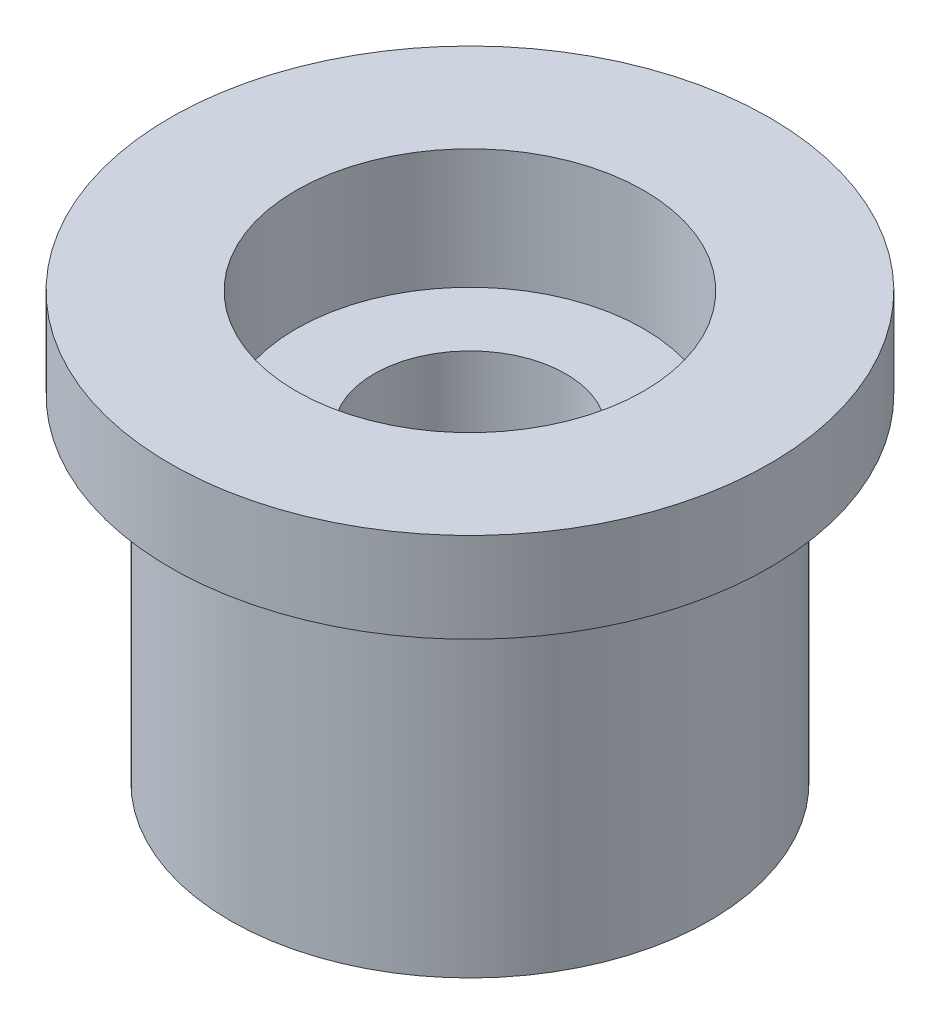
ISO-10303-21;
HEADER;
FILE_DESCRIPTION(('STEP AP214'),'2;1');
FILE_NAME('part.step','',(''),(''),'','','');
FILE_SCHEMA(('AUTOMOTIVE_DESIGN { 1 0 10303 214 1 1 1 1 }'));
ENDSEC;
DATA;
#1=APPLICATION_CONTEXT('core data for automotive mechanical design processes');
#2=APPLICATION_PROTOCOL_DEFINITION('international standard','automotive_design',2000,#1);
#3=PRODUCT_CONTEXT('',#1,'mechanical');
#4=PRODUCT('Part','Part','',(#3));
#5=PRODUCT_RELATED_PRODUCT_CATEGORY('part','',(#4));
#6=PRODUCT_DEFINITION_FORMATION('','',#4);
#7=PRODUCT_DEFINITION_CONTEXT('part definition',#1,'design');
#8=PRODUCT_DEFINITION('design','',#6,#7);
#9=PRODUCT_DEFINITION_SHAPE('','',#8);
#10=(LENGTH_UNIT() NAMED_UNIT(*) SI_UNIT(.MILLI.,.METRE.));
#11=(NAMED_UNIT(*) PLANE_ANGLE_UNIT() SI_UNIT($,.RADIAN.));
#12=(NAMED_UNIT(*) SI_UNIT($,.STERADIAN.) SOLID_ANGLE_UNIT());
#13=UNCERTAINTY_MEASURE_WITH_UNIT(LENGTH_MEASURE(1.E-05),#10,'distance_accuracy_value','');
#14=(GEOMETRIC_REPRESENTATION_CONTEXT(3) GLOBAL_UNCERTAINTY_ASSIGNED_CONTEXT((#13)) GLOBAL_UNIT_ASSIGNED_CONTEXT((#10,
#11,#12)) REPRESENTATION_CONTEXT('',''));
#15=CARTESIAN_POINT('',(0.,0.,0.));
#16=DIRECTION('',(0.,0.,1.));
#17=DIRECTION('',(1.,0.,0.));
#18=AXIS2_PLACEMENT_3D('',#15,#16,#17);
#19=CARTESIAN_POINT('',(0.,7.1,0.));
#20=DIRECTION('',(0.,1.,0.));
#21=DIRECTION('',(0.,0.,1.));
#22=AXIS2_PLACEMENT_3D('',#19,#20,#21);
#23=CYLINDRICAL_SURFACE('',#22,2.9);
#24=CARTESIAN_POINT('',(0.,5.1,0.));
#25=DIRECTION('',(0.,1.,0.));
#26=DIRECTION('',(0.,0.,1.));
#27=AXIS2_PLACEMENT_3D('',#24,#25,#26);
#28=CIRCLE('',#27,2.9);
#29=CARTESIAN_POINT('',(0.,5.1,2.9));
#30=VERTEX_POINT('',#29);
#31=EDGE_CURVE('E19',#30,#30,#28,.T.);
#32=ORIENTED_EDGE('',*,*,#31,.F.);
#33=EDGE_LOOP('',(#32));
#34=FACE_BOUND('',#33,.T.);
#35=CARTESIAN_POINT('',(0.,7.1,0.));
#36=DIRECTION('',(0.,1.,0.));
#37=DIRECTION('',(0.,0.,1.));
#38=AXIS2_PLACEMENT_3D('',#35,#36,#37);
#39=CIRCLE('',#38,2.9);
#40=CARTESIAN_POINT('',(0.,7.1,2.9));
#41=VERTEX_POINT('',#40);
#42=EDGE_CURVE('E132',#41,#41,#39,.F.);
#43=ORIENTED_EDGE('',*,*,#42,.F.);
#44=EDGE_LOOP('',(#43));
#45=FACE_BOUND('',#44,.T.);
#46=ADVANCED_FACE('F16',(#34,#45),#23,.F.);
#47=CARTESIAN_POINT('',(2.264950330581,0.,0.4));
#48=DIRECTION('',(0.,0.,1.));
#49=DIRECTION('',(1.,0.,0.));
#50=AXIS2_PLACEMENT_3D('',#47,#48,#49);
#51=PLANE('',#50);
#52=DIRECTION('',(0.,-1.,0.));
#53=VECTOR('',#52,1.);
#54=CARTESIAN_POINT('',(3.07408522978788,0.,0.399999999999985));
#55=LINE('',#54,#53);
#56=CARTESIAN_POINT('',(3.07408522978788,0.,0.399999999999992));
#57=VERTEX_POINT('',#56);
#58=CARTESIAN_POINT('',(3.07408522978788,4.3,0.399999999999992));
#59=VERTEX_POINT('',#58);
#60=EDGE_CURVE('E127',#57,#59,#55,.F.);
#61=ORIENTED_EDGE('',*,*,#60,.T.);
#62=DIRECTION('',(1.,0.,0.));
#63=VECTOR('',#62,1.);
#64=CARTESIAN_POINT('',(0.,4.3,0.4));
#65=LINE('',#64,#63);
#66=CARTESIAN_POINT('',(2.26495033058122,4.3,0.400000000000019));
#67=VERTEX_POINT('',#66);
#68=EDGE_CURVE('E102',#67,#59,#65,.T.);
#69=ORIENTED_EDGE('',*,*,#68,.F.);
#70=DIRECTION('',(0.,-1.,0.));
#71=VECTOR('',#70,1.);
#72=CARTESIAN_POINT('',(2.26495033058122,0.,0.400000000000039));
#73=LINE('',#72,#71);
#74=CARTESIAN_POINT('',(2.26495033058122,0.,0.400000000000019));
#75=VERTEX_POINT('',#74);
#76=EDGE_CURVE('E130',#75,#67,#73,.F.);
#77=ORIENTED_EDGE('',*,*,#76,.F.);
#78=DIRECTION('',(1.,0.,0.));
#79=VECTOR('',#78,1.);
#80=CARTESIAN_POINT('',(2.264950330581,0.,0.4));
#81=LINE('',#80,#79);
#82=EDGE_CURVE('E162',#75,#57,#81,.T.);
#83=ORIENTED_EDGE('',*,*,#82,.T.);
#84=EDGE_LOOP('',(#61,#69,#77,#83));
#85=FACE_BOUND('',#84,.T.);
#86=ADVANCED_FACE('F221',(#85),#51,.T.);
#87=CARTESIAN_POINT('',(0.,4.3,0.));
#88=DIRECTION('',(0.,-1.,0.));
#89=DIRECTION('',(0.,0.,-1.));
#90=AXIS2_PLACEMENT_3D('',#87,#88,#89);
#91=PLANE('',#90);
#92=CARTESIAN_POINT('',(0.,4.3,0.));
#93=DIRECTION('',(0.,-1.,0.));
#94=DIRECTION('',(0.,0.,-1.));
#95=AXIS2_PLACEMENT_3D('',#92,#93,#94);
#96=CIRCLE('',#95,2.3);
#97=CARTESIAN_POINT('',(-0.786065003776618,4.3,2.16150452459338));
#98=VERTEX_POINT('',#97);
#99=EDGE_CURVE('E111',#67,#98,#96,.T.);
#100=ORIENTED_EDGE('',*,*,#99,.F.);
#101=ORIENTED_EDGE('',*,*,#68,.T.);
#102=CARTESIAN_POINT('',(0.,4.3,0.));
#103=DIRECTION('',(0.,-1.,0.));
#104=DIRECTION('',(0.,0.,-1.));
#105=AXIS2_PLACEMENT_3D('',#102,#103,#104);
#106=CIRCLE('',#105,3.1);
#107=CARTESIAN_POINT('',(-1.19063245337983,4.3,2.86223590239497));
#108=VERTEX_POINT('',#107);
#109=EDGE_CURVE('E114',#59,#108,#106,.T.);
#110=ORIENTED_EDGE('',*,*,#109,.T.);
#111=DIRECTION('',(0.500000000000017,0.,-0.866025403784429));
#112=VECTOR('',#111,1.);
#113=CARTESIAN_POINT('',(-1.643564712699,4.3,3.646737587923));
#114=LINE('',#113,#112);
#115=EDGE_CURVE('E107',#98,#108,#114,.F.);
#116=ORIENTED_EDGE('',*,*,#115,.F.);
#117=EDGE_LOOP('',(#100,#101,#110,#116));
#118=FACE_BOUND('',#117,.T.);
#119=ADVANCED_FACE('F109',(#118),#91,.T.);
#120=CARTESIAN_POINT('',(-1.643564712699,0.,3.646737587923));
#121=DIRECTION('',(0.866025403784429,0.,0.500000000000017));
#122=DIRECTION('',(0.500000000000017,0.,-0.866025403784429));
#123=AXIS2_PLACEMENT_3D('',#120,#121,#122);
#124=PLANE('',#123);
#125=DIRECTION('',(0.,-1.,0.));
#126=VECTOR('',#125,1.);
#127=CARTESIAN_POINT('',(-0.786065003776901,0.,2.16150452459328));
#128=LINE('',#127,#126);
#129=CARTESIAN_POINT('',(-0.786065003776618,0.,2.16150452459338));
#130=VERTEX_POINT('',#129);
#131=EDGE_CURVE('E122',#98,#130,#128,.T.);
#132=ORIENTED_EDGE('',*,*,#131,.F.);
#133=ORIENTED_EDGE('',*,*,#115,.T.);
#134=DIRECTION('',(0.,-1.,0.));
#135=VECTOR('',#134,1.);
#136=CARTESIAN_POINT('',(-1.19063245337996,0.,2.86223590239491));
#137=LINE('',#136,#135);
#138=CARTESIAN_POINT('',(-1.19063245337983,0.,2.86223590239497));
#139=VERTEX_POINT('',#138);
#140=EDGE_CURVE('E210',#108,#139,#137,.T.);
#141=ORIENTED_EDGE('',*,*,#140,.T.);
#142=DIRECTION('',(0.500000000000017,0.,-0.866025403784429));
#143=VECTOR('',#142,1.);
#144=CARTESIAN_POINT('',(-1.643564712699,0.,3.646737587923));
#145=LINE('',#144,#143);
#146=EDGE_CURVE('E119',#139,#130,#145,.T.);
#147=ORIENTED_EDGE('',*,*,#146,.T.);
#148=EDGE_LOOP('',(#132,#133,#141,#147));
#149=FACE_BOUND('',#148,.T.);
#150=ADVANCED_FACE('F123',(#149),#124,.T.);
#151=CARTESIAN_POINT('',(3.979949748426,0.,-0.4));
#152=DIRECTION('',(0.,0.,-1.));
#153=DIRECTION('',(-1.,0.,0.));
#154=AXIS2_PLACEMENT_3D('',#151,#152,#153);
#155=PLANE('',#154);
#156=DIRECTION('',(0.,-1.,0.));
#157=VECTOR('',#156,1.);
#158=CARTESIAN_POINT('',(2.26495033058122,0.,-0.400000000000038));
#159=LINE('',#158,#157);
#160=CARTESIAN_POINT('',(2.26495033058122,4.3,-0.400000000000019));
#161=VERTEX_POINT('',#160);
#162=CARTESIAN_POINT('',(2.26495033058122,0.,-0.400000000000019));
#163=VERTEX_POINT('',#162);
#164=EDGE_CURVE('E609',#161,#163,#159,.T.);
#165=ORIENTED_EDGE('',*,*,#164,.F.);
#166=DIRECTION('',(1.,0.,0.));
#167=VECTOR('',#166,1.);
#168=CARTESIAN_POINT('',(0.,4.3,-0.4));
#169=LINE('',#168,#167);
#170=CARTESIAN_POINT('',(3.07408522978788,4.3,-0.399999999999992));
#171=VERTEX_POINT('',#170);
#172=EDGE_CURVE('E152',#171,#161,#169,.F.);
#173=ORIENTED_EDGE('',*,*,#172,.F.);
#174=DIRECTION('',(0.,-1.,0.));
#175=VECTOR('',#174,1.);
#176=CARTESIAN_POINT('',(3.07408522978788,0.,-0.399999999999985));
#177=LINE('',#176,#175);
#178=CARTESIAN_POINT('',(3.07408522978788,0.,-0.399999999999992));
#179=VERTEX_POINT('',#178);
#180=EDGE_CURVE('E209',#171,#179,#177,.T.);
#181=ORIENTED_EDGE('',*,*,#180,.T.);
#182=DIRECTION('',(-1.,0.,0.));
#183=VECTOR('',#182,1.);
#184=CARTESIAN_POINT('',(3.979949748426,0.,-0.4));
#185=LINE('',#184,#183);
#186=EDGE_CURVE('E118',#179,#163,#185,.T.);
#187=ORIENTED_EDGE('',*,*,#186,.T.);
#188=EDGE_LOOP('',(#165,#173,#181,#187));
#189=FACE_BOUND('',#188,.T.);
#190=ADVANCED_FACE('F282',(#189),#155,.T.);
#191=CARTESIAN_POINT('',(-0.7860650037768,0.,-2.161504524593));
#192=DIRECTION('',(0.866025403784429,0.,-0.500000000000017));
#193=DIRECTION('',(-0.500000000000017,0.,-0.866025403784429));
#194=AXIS2_PLACEMENT_3D('',#191,#192,#193);
#195=PLANE('',#194);
#196=DIRECTION('',(0.,-1.,0.));
#197=VECTOR('',#196,1.);
#198=CARTESIAN_POINT('',(-1.19063245337996,0.,-2.86223590239491));
#199=LINE('',#198,#197);
#200=CARTESIAN_POINT('',(-1.19063245338013,0.,-2.86223590239484));
#201=VERTEX_POINT('',#200);
#202=CARTESIAN_POINT('',(-1.19063245337996,4.3,-2.86223590239491));
#203=VERTEX_POINT('',#202);
#204=EDGE_CURVE('E215',#201,#203,#199,.F.);
#205=ORIENTED_EDGE('',*,*,#204,.T.);
#206=DIRECTION('',(-0.499999999999627,0.,-0.866025403784654));
#207=VECTOR('',#206,1.);
#208=CARTESIAN_POINT('',(-0.7860650037768,4.3,-2.161504524593));
#209=LINE('',#208,#207);
#210=CARTESIAN_POINT('',(-0.786065003776926,4.3,-2.16150452459327));
#211=VERTEX_POINT('',#210);
#212=EDGE_CURVE('E155',#211,#203,#209,.T.);
#213=ORIENTED_EDGE('',*,*,#212,.F.);
#214=DIRECTION('',(0.,-1.,0.));
#215=VECTOR('',#214,1.);
#216=CARTESIAN_POINT('',(-0.786065003776902,0.,-2.16150452459328));
#217=LINE('',#216,#215);
#218=CARTESIAN_POINT('',(-0.786065003776927,0.,-2.16150452459327));
#219=VERTEX_POINT('',#218);
#220=EDGE_CURVE('E206',#219,#211,#217,.F.);
#221=ORIENTED_EDGE('',*,*,#220,.F.);
#222=DIRECTION('',(-0.500000000000017,0.,-0.866025403784429));
#223=VECTOR('',#222,1.);
#224=CARTESIAN_POINT('',(-0.7860650037768,0.,-2.161504524593));
#225=LINE('',#224,#223);
#226=EDGE_CURVE('E157',#219,#201,#225,.T.);
#227=ORIENTED_EDGE('',*,*,#226,.T.);
#228=EDGE_LOOP('',(#205,#213,#221,#227));
#229=FACE_BOUND('',#228,.T.);
#230=ADVANCED_FACE('F279',(#229),#195,.T.);
#231=CARTESIAN_POINT('',(0.,4.3,0.));
#232=DIRECTION('',(0.,-1.,0.));
#233=DIRECTION('',(0.,0.,-1.));
#234=AXIS2_PLACEMENT_3D('',#231,#232,#233);
#235=PLANE('',#234);
#236=CARTESIAN_POINT('',(0.,4.3,0.));
#237=DIRECTION('',(0.,-1.,0.));
#238=DIRECTION('',(0.,0.,-1.));
#239=AXIS2_PLACEMENT_3D('',#236,#237,#238);
#240=CIRCLE('',#239,3.1);
#241=EDGE_CURVE('E207',#203,#171,#240,.T.);
#242=ORIENTED_EDGE('',*,*,#241,.T.);
#243=ORIENTED_EDGE('',*,*,#172,.T.);
#244=CARTESIAN_POINT('',(0.,4.3,0.));
#245=DIRECTION('',(0.,-1.,0.));
#246=DIRECTION('',(0.,0.,-1.));
#247=AXIS2_PLACEMENT_3D('',#244,#245,#246);
#248=CIRCLE('',#247,2.3);
#249=EDGE_CURVE('E204',#211,#161,#248,.T.);
#250=ORIENTED_EDGE('',*,*,#249,.F.);
#251=ORIENTED_EDGE('',*,*,#212,.T.);
#252=EDGE_LOOP('',(#242,#243,#250,#251));
#253=FACE_BOUND('',#252,.T.);
#254=ADVANCED_FACE('F275',(#253),#235,.T.);
#255=CARTESIAN_POINT('',(0.,5.1,0.));
#256=DIRECTION('',(0.,1.,0.));
#257=DIRECTION('',(0.,0.,1.));
#258=AXIS2_PLACEMENT_3D('',#255,#256,#257);
#259=PLANE('',#258);
#260=CARTESIAN_POINT('',(0.,5.1,0.));
#261=DIRECTION('',(0.,1.,0.));
#262=DIRECTION('',(0.,0.,1.));
#263=AXIS2_PLACEMENT_3D('',#260,#261,#262);
#264=CIRCLE('',#263,1.6);
#265=CARTESIAN_POINT('',(0.,5.1,1.6));
#266=VERTEX_POINT('',#265);
#267=EDGE_CURVE('E201',#266,#266,#264,.F.);
#268=ORIENTED_EDGE('',*,*,#267,.T.);
#269=EDGE_LOOP('',(#268));
#270=FACE_BOUND('',#269,.T.);
#271=ORIENTED_EDGE('',*,*,#31,.T.);
#272=EDGE_LOOP('',(#271));
#273=FACE_BOUND('',#272,.T.);
#274=ADVANCED_FACE('F271',(#270,#273),#259,.T.);
#275=CARTESIAN_POINT('',(0.,4.3,0.));
#276=DIRECTION('',(0.,-1.,0.));
#277=DIRECTION('',(0.,0.,-1.));
#278=AXIS2_PLACEMENT_3D('',#275,#276,#277);
#279=PLANE('',#278);
#280=CARTESIAN_POINT('',(0.,4.3,0.));
#281=DIRECTION('',(0.,-1.,0.));
#282=DIRECTION('',(0.,0.,-1.));
#283=AXIS2_PLACEMENT_3D('',#280,#281,#282);
#284=CIRCLE('',#283,2.3);
#285=CARTESIAN_POINT('',(-1.47888532680428,4.3,1.7615045245934));
#286=VERTEX_POINT('',#285);
#287=CARTESIAN_POINT('',(-1.4788853268043,4.3,-1.76150452459338));
#288=VERTEX_POINT('',#287);
#289=EDGE_CURVE('E193',#286,#288,#284,.T.);
#290=ORIENTED_EDGE('',*,*,#289,.F.);
#291=DIRECTION('',(-0.500000000000017,0.,0.866025403784429));
#292=VECTOR('',#291,1.);
#293=CARTESIAN_POINT('',(-1.478885326804,4.3,1.761504524593));
#294=LINE('',#293,#292);
#295=CARTESIAN_POINT('',(-1.8834527764077,4.3,2.46223590239484));
#296=VERTEX_POINT('',#295);
#297=EDGE_CURVE('E137',#296,#286,#294,.F.);
#298=ORIENTED_EDGE('',*,*,#297,.F.);
#299=CARTESIAN_POINT('',(0.,4.3,0.));
#300=DIRECTION('',(0.,-1.,0.));
#301=DIRECTION('',(0.,0.,-1.));
#302=AXIS2_PLACEMENT_3D('',#299,#300,#301);
#303=CIRCLE('',#302,3.1);
#304=CARTESIAN_POINT('',(-1.88345277640771,4.3,-2.46223590239483));
#305=VERTEX_POINT('',#304);
#306=EDGE_CURVE('E198',#296,#305,#303,.T.);
#307=ORIENTED_EDGE('',*,*,#306,.T.);
#308=DIRECTION('',(0.500000000000017,0.,0.866025403784429));
#309=VECTOR('',#308,1.);
#310=CARTESIAN_POINT('',(-2.336385035727,4.3,-3.246737587923));
#311=LINE('',#310,#309);
#312=EDGE_CURVE('E145',#288,#305,#311,.F.);
#313=ORIENTED_EDGE('',*,*,#312,.F.);
#314=EDGE_LOOP('',(#290,#298,#307,#313));
#315=FACE_BOUND('',#314,.T.);
#316=ADVANCED_FACE('F267',(#315),#279,.T.);
#317=CARTESIAN_POINT('',(-2.336385035727,0.,-3.246737587923));
#318=DIRECTION('',(-0.866025403784429,0.,0.500000000000017));
#319=DIRECTION('',(0.500000000000017,0.,0.866025403784429));
#320=AXIS2_PLACEMENT_3D('',#317,#318,#319);
#321=PLANE('',#320);
#322=DIRECTION('',(0.,-1.,0.));
#323=VECTOR('',#322,1.);
#324=CARTESIAN_POINT('',(-1.47888532680431,0.,-1.76150452459337));
#325=LINE('',#324,#323);
#326=CARTESIAN_POINT('',(-1.4788853268043,0.,-1.76150452459338));
#327=VERTEX_POINT('',#326);
#328=EDGE_CURVE('E196',#288,#327,#325,.T.);
#329=ORIENTED_EDGE('',*,*,#328,.F.);
#330=ORIENTED_EDGE('',*,*,#312,.T.);
#331=DIRECTION('',(0.,-1.,0.));
#332=VECTOR('',#331,1.);
#333=CARTESIAN_POINT('',(-1.88345277640781,0.,-2.46223590239475));
#334=LINE('',#333,#332);
#335=CARTESIAN_POINT('',(-1.88345277640771,0.,-2.46223590239483));
#336=VERTEX_POINT('',#335);
#337=EDGE_CURVE('E197',#305,#336,#334,.T.);
#338=ORIENTED_EDGE('',*,*,#337,.T.);
#339=DIRECTION('',(0.500000000000017,0.,0.866025403784429));
#340=VECTOR('',#339,1.);
#341=CARTESIAN_POINT('',(-2.336385035727,0.,-3.246737587923));
#342=LINE('',#341,#340);
#343=EDGE_CURVE('E148',#336,#327,#342,.T.);
#344=ORIENTED_EDGE('',*,*,#343,.T.);
#345=EDGE_LOOP('',(#329,#330,#338,#344));
#346=FACE_BOUND('',#345,.T.);
#347=ADVANCED_FACE('F261',(#346),#321,.T.);
#348=CARTESIAN_POINT('',(-1.478885326804,0.,1.761504524593));
#349=DIRECTION('',(-0.866025403784429,0.,-0.500000000000017));
#350=DIRECTION('',(-0.500000000000017,0.,0.866025403784429));
#351=AXIS2_PLACEMENT_3D('',#348,#349,#350);
#352=PLANE('',#351);
#353=DIRECTION('',(0.,-1.,0.));
#354=VECTOR('',#353,1.);
#355=CARTESIAN_POINT('',(-1.88345277640781,0.,2.46223590239475));
#356=LINE('',#355,#354);
#357=CARTESIAN_POINT('',(-1.8834527764077,0.,2.46223590239484));
#358=VERTEX_POINT('',#357);
#359=EDGE_CURVE('E200',#358,#296,#356,.F.);
#360=ORIENTED_EDGE('',*,*,#359,.T.);
#361=ORIENTED_EDGE('',*,*,#297,.T.);
#362=DIRECTION('',(0.,-1.,0.));
#363=VECTOR('',#362,1.);
#364=CARTESIAN_POINT('',(-1.47888532680431,0.,1.76150452459337));
#365=LINE('',#364,#363);
#366=CARTESIAN_POINT('',(-1.47888532680428,0.,1.7615045245934));
#367=VERTEX_POINT('',#366);
#368=EDGE_CURVE('E192',#367,#286,#365,.F.);
#369=ORIENTED_EDGE('',*,*,#368,.F.);
#370=DIRECTION('',(-0.500000000000017,0.,0.866025403784429));
#371=VECTOR('',#370,1.);
#372=CARTESIAN_POINT('',(-1.478885326804,0.,1.761504524593));
#373=LINE('',#372,#371);
#374=EDGE_CURVE('E34',#367,#358,#373,.T.);
#375=ORIENTED_EDGE('',*,*,#374,.T.);
#376=EDGE_LOOP('',(#360,#361,#369,#375));
#377=FACE_BOUND('',#376,.T.);
#378=ADVANCED_FACE('F253',(#377),#352,.T.);
#379=CARTESIAN_POINT('',(0.,7.1,0.));
#380=DIRECTION('',(0.,1.,0.));
#381=DIRECTION('',(0.,0.,1.));
#382=AXIS2_PLACEMENT_3D('',#379,#380,#381);
#383=PLANE('',#382);
#384=ORIENTED_EDGE('',*,*,#42,.T.);
#385=EDGE_LOOP('',(#384));
#386=FACE_BOUND('',#385,.T.);
#387=CARTESIAN_POINT('',(0.,7.1,0.));
#388=DIRECTION('',(0.,-1.,0.));
#389=DIRECTION('',(0.,0.,-1.));
#390=AXIS2_PLACEMENT_3D('',#387,#388,#389);
#391=CIRCLE('',#390,5.);
#392=CARTESIAN_POINT('',(0.,7.1,-5.));
#393=VERTEX_POINT('',#392);
#394=EDGE_CURVE('E189',#393,#393,#391,.T.);
#395=ORIENTED_EDGE('',*,*,#394,.F.);
#396=EDGE_LOOP('',(#395));
#397=FACE_BOUND('',#396,.T.);
#398=ADVANCED_FACE('F251',(#386,#397),#383,.T.);
#399=CARTESIAN_POINT('',(0.,0.,0.));
#400=DIRECTION('',(0.,-1.,0.));
#401=DIRECTION('',(0.,0.,-1.));
#402=AXIS2_PLACEMENT_3D('',#399,#400,#401);
#403=CYLINDRICAL_SURFACE('',#402,2.3);
#404=ORIENTED_EDGE('',*,*,#131,.T.);
#405=CARTESIAN_POINT('',(0.,0.,0.));
#406=DIRECTION('',(0.,-1.,0.));
#407=DIRECTION('',(0.,0.,-1.));
#408=AXIS2_PLACEMENT_3D('',#405,#406,#407);
#409=CIRCLE('',#408,2.3);
#410=EDGE_CURVE('E187',#130,#75,#409,.F.);
#411=ORIENTED_EDGE('',*,*,#410,.T.);
#412=ORIENTED_EDGE('',*,*,#76,.T.);
#413=ORIENTED_EDGE('',*,*,#99,.T.);
#414=EDGE_LOOP('',(#404,#411,#412,#413));
#415=FACE_BOUND('',#414,.T.);
#416=ADVANCED_FACE('F129',(#415),#403,.T.);
#417=CARTESIAN_POINT('',(0.,0.,0.));
#418=DIRECTION('',(0.,-1.,0.));
#419=DIRECTION('',(0.,0.,-1.));
#420=AXIS2_PLACEMENT_3D('',#417,#418,#419);
#421=CYLINDRICAL_SURFACE('',#420,3.1);
#422=ORIENTED_EDGE('',*,*,#109,.F.);
#423=ORIENTED_EDGE('',*,*,#60,.F.);
#424=CARTESIAN_POINT('',(0.,0.,0.));
#425=DIRECTION('',(0.,-1.,0.));
#426=DIRECTION('',(0.,0.,-1.));
#427=AXIS2_PLACEMENT_3D('',#424,#425,#426);
#428=CIRCLE('',#427,3.1);
#429=EDGE_CURVE('E184',#57,#139,#428,.T.);
#430=ORIENTED_EDGE('',*,*,#429,.T.);
#431=ORIENTED_EDGE('',*,*,#140,.F.);
#432=EDGE_LOOP('',(#422,#423,#430,#431));
#433=FACE_BOUND('',#432,.T.);
#434=ADVANCED_FACE('F224',(#433),#421,.F.);
#435=CARTESIAN_POINT('',(0.,0.,0.));
#436=DIRECTION('',(0.,-1.,0.));
#437=DIRECTION('',(0.,0.,-1.));
#438=AXIS2_PLACEMENT_3D('',#435,#436,#437);
#439=CYLINDRICAL_SURFACE('',#438,3.1);
#440=CARTESIAN_POINT('',(0.,0.,0.));
#441=DIRECTION('',(0.,-1.,0.));
#442=DIRECTION('',(0.,0.,-1.));
#443=AXIS2_PLACEMENT_3D('',#440,#441,#442);
#444=CIRCLE('',#443,3.1);
#445=EDGE_CURVE('E181',#201,#179,#444,.T.);
#446=ORIENTED_EDGE('',*,*,#445,.T.);
#447=ORIENTED_EDGE('',*,*,#180,.F.);
#448=ORIENTED_EDGE('',*,*,#241,.F.);
#449=ORIENTED_EDGE('',*,*,#204,.F.);
#450=EDGE_LOOP('',(#446,#447,#448,#449));
#451=FACE_BOUND('',#450,.T.);
#452=ADVANCED_FACE('F416',(#451),#439,.F.);
#453=CARTESIAN_POINT('',(0.,0.,0.));
#454=DIRECTION('',(0.,-1.,0.));
#455=DIRECTION('',(0.,0.,-1.));
#456=AXIS2_PLACEMENT_3D('',#453,#454,#455);
#457=CYLINDRICAL_SURFACE('',#456,2.3);
#458=ORIENTED_EDGE('',*,*,#220,.T.);
#459=ORIENTED_EDGE('',*,*,#249,.T.);
#460=ORIENTED_EDGE('',*,*,#164,.T.);
#461=CARTESIAN_POINT('',(0.,0.,0.));
#462=DIRECTION('',(0.,-1.,0.));
#463=DIRECTION('',(0.,0.,-1.));
#464=AXIS2_PLACEMENT_3D('',#461,#462,#463);
#465=CIRCLE('',#464,2.3);
#466=EDGE_CURVE('E178',#163,#219,#465,.F.);
#467=ORIENTED_EDGE('',*,*,#466,.T.);
#468=EDGE_LOOP('',(#458,#459,#460,#467));
#469=FACE_BOUND('',#468,.T.);
#470=ADVANCED_FACE('F426',(#469),#457,.T.);
#471=CARTESIAN_POINT('',(0.,7.1,0.));
#472=DIRECTION('',(0.,1.,0.));
#473=DIRECTION('',(0.,0.,1.));
#474=AXIS2_PLACEMENT_3D('',#471,#472,#473);
#475=CYLINDRICAL_SURFACE('',#474,1.6);
#476=CARTESIAN_POINT('',(0.,0.,0.));
#477=DIRECTION('',(0.,1.,0.));
#478=DIRECTION('',(0.,0.,1.));
#479=AXIS2_PLACEMENT_3D('',#476,#477,#478);
#480=CIRCLE('',#479,1.6);
#481=CARTESIAN_POINT('',(0.,0.,1.6));
#482=VERTEX_POINT('',#481);
#483=EDGE_CURVE('E175',#482,#482,#480,.F.);
#484=ORIENTED_EDGE('',*,*,#483,.T.);
#485=EDGE_LOOP('',(#484));
#486=FACE_BOUND('',#485,.T.);
#487=ORIENTED_EDGE('',*,*,#267,.F.);
#488=EDGE_LOOP('',(#487));
#489=FACE_BOUND('',#488,.T.);
#490=ADVANCED_FACE('F438',(#486,#489),#475,.F.);
#491=CARTESIAN_POINT('',(0.,0.,0.));
#492=DIRECTION('',(0.,-1.,0.));
#493=DIRECTION('',(0.,0.,-1.));
#494=AXIS2_PLACEMENT_3D('',#491,#492,#493);
#495=CYLINDRICAL_SURFACE('',#494,3.1);
#496=ORIENTED_EDGE('',*,*,#337,.F.);
#497=ORIENTED_EDGE('',*,*,#306,.F.);
#498=ORIENTED_EDGE('',*,*,#359,.F.);
#499=CARTESIAN_POINT('',(0.,0.,0.));
#500=DIRECTION('',(0.,-1.,0.));
#501=DIRECTION('',(0.,0.,-1.));
#502=AXIS2_PLACEMENT_3D('',#499,#500,#501);
#503=CIRCLE('',#502,3.1);
#504=EDGE_CURVE('E172',#358,#336,#503,.T.);
#505=ORIENTED_EDGE('',*,*,#504,.T.);
#506=EDGE_LOOP('',(#496,#497,#498,#505));
#507=FACE_BOUND('',#506,.T.);
#508=ADVANCED_FACE('F450',(#507),#495,.F.);
#509=CARTESIAN_POINT('',(0.,0.,0.));
#510=DIRECTION('',(0.,-1.,0.));
#511=DIRECTION('',(0.,0.,-1.));
#512=AXIS2_PLACEMENT_3D('',#509,#510,#511);
#513=CYLINDRICAL_SURFACE('',#512,2.3);
#514=CARTESIAN_POINT('',(0.,0.,0.));
#515=DIRECTION('',(0.,-1.,0.));
#516=DIRECTION('',(0.,0.,-1.));
#517=AXIS2_PLACEMENT_3D('',#514,#515,#516);
#518=CIRCLE('',#517,2.3);
#519=EDGE_CURVE('E169',#327,#367,#518,.F.);
#520=ORIENTED_EDGE('',*,*,#519,.T.);
#521=ORIENTED_EDGE('',*,*,#368,.T.);
#522=ORIENTED_EDGE('',*,*,#289,.T.);
#523=ORIENTED_EDGE('',*,*,#328,.T.);
#524=EDGE_LOOP('',(#520,#521,#522,#523));
#525=FACE_BOUND('',#524,.T.);
#526=ADVANCED_FACE('F247',(#525),#513,.T.);
#527=CARTESIAN_POINT('',(0.,7.1,0.));
#528=DIRECTION('',(0.,-1.,0.));
#529=DIRECTION('',(0.,0.,-1.));
#530=AXIS2_PLACEMENT_3D('',#527,#528,#529);
#531=CYLINDRICAL_SURFACE('',#530,5.);
#532=CARTESIAN_POINT('',(0.,5.6,0.));
#533=DIRECTION('',(0.,-1.,0.));
#534=DIRECTION('',(0.,0.,-1.));
#535=AXIS2_PLACEMENT_3D('',#532,#533,#534);
#536=CIRCLE('',#535,5.);
#537=CARTESIAN_POINT('',(0.,5.6,-5.));
#538=VERTEX_POINT('',#537);
#539=EDGE_CURVE('E166',#538,#538,#536,.T.);
#540=ORIENTED_EDGE('',*,*,#539,.F.);
#541=EDGE_LOOP('',(#540));
#542=FACE_BOUND('',#541,.T.);
#543=ORIENTED_EDGE('',*,*,#394,.T.);
#544=EDGE_LOOP('',(#543));
#545=FACE_BOUND('',#544,.T.);
#546=ADVANCED_FACE('F230',(#542,#545),#531,.T.);
#547=CARTESIAN_POINT('',(0.,0.,0.));
#548=DIRECTION('',(0.,1.,0.));
#549=DIRECTION('',(0.,0.,1.));
#550=AXIS2_PLACEMENT_3D('',#547,#548,#549);
#551=PLANE('',#550);
#552=ORIENTED_EDGE('',*,*,#519,.F.);
#553=ORIENTED_EDGE('',*,*,#343,.F.);
#554=ORIENTED_EDGE('',*,*,#504,.F.);
#555=ORIENTED_EDGE('',*,*,#374,.F.);
#556=EDGE_LOOP('',(#552,#553,#554,#555));
#557=FACE_BOUND('',#556,.T.);
#558=ORIENTED_EDGE('',*,*,#483,.F.);
#559=EDGE_LOOP('',(#558));
#560=FACE_BOUND('',#559,.T.);
#561=ORIENTED_EDGE('',*,*,#466,.F.);
#562=ORIENTED_EDGE('',*,*,#186,.F.);
#563=ORIENTED_EDGE('',*,*,#445,.F.);
#564=ORIENTED_EDGE('',*,*,#226,.F.);
#565=EDGE_LOOP('',(#561,#562,#563,#564));
#566=FACE_BOUND('',#565,.T.);
#567=ORIENTED_EDGE('',*,*,#429,.F.);
#568=ORIENTED_EDGE('',*,*,#82,.F.);
#569=ORIENTED_EDGE('',*,*,#410,.F.);
#570=ORIENTED_EDGE('',*,*,#146,.F.);
#571=EDGE_LOOP('',(#567,#568,#569,#570));
#572=FACE_BOUND('',#571,.T.);
#573=CARTESIAN_POINT('',(0.,0.,0.));
#574=DIRECTION('',(0.,1.,0.));
#575=DIRECTION('',(0.,0.,1.));
#576=AXIS2_PLACEMENT_3D('',#573,#574,#575);
#577=CIRCLE('',#576,4.);
#578=CARTESIAN_POINT('',(0.,0.,4.));
#579=VERTEX_POINT('',#578);
#580=EDGE_CURVE('E25',#579,#579,#577,.T.);
#581=ORIENTED_EDGE('',*,*,#580,.F.);
#582=EDGE_LOOP('',(#581));
#583=FACE_BOUND('',#582,.T.);
#584=ADVANCED_FACE('F226',(#557,#560,#566,#572,#583),#551,.F.);
#585=CARTESIAN_POINT('',(0.,5.6,0.));
#586=DIRECTION('',(0.,-1.,0.));
#587=DIRECTION('',(0.,0.,-1.));
#588=AXIS2_PLACEMENT_3D('',#585,#586,#587);
#589=PLANE('',#588);
#590=CARTESIAN_POINT('',(0.,5.6,0.));
#591=DIRECTION('',(0.,1.,0.));
#592=DIRECTION('',(0.,0.,1.));
#593=AXIS2_PLACEMENT_3D('',#590,#591,#592);
#594=CIRCLE('',#593,4.);
#595=CARTESIAN_POINT('',(0.,5.6,4.));
#596=VERTEX_POINT('',#595);
#597=EDGE_CURVE('E11',#596,#596,#594,.F.);
#598=ORIENTED_EDGE('',*,*,#597,.F.);
#599=EDGE_LOOP('',(#598));
#600=FACE_BOUND('',#599,.T.);
#601=ORIENTED_EDGE('',*,*,#539,.T.);
#602=EDGE_LOOP('',(#601));
#603=FACE_BOUND('',#602,.T.);
#604=ADVANCED_FACE('F229',(#600,#603),#589,.T.);
#605=CARTESIAN_POINT('',(0.,0.,0.));
#606=DIRECTION('',(0.,1.,0.));
#607=DIRECTION('',(0.,0.,1.));
#608=AXIS2_PLACEMENT_3D('',#605,#606,#607);
#609=CYLINDRICAL_SURFACE('',#608,4.);
#610=ORIENTED_EDGE('',*,*,#580,.T.);
#611=EDGE_LOOP('',(#610));
#612=FACE_BOUND('',#611,.T.);
#613=ORIENTED_EDGE('',*,*,#597,.T.);
#614=EDGE_LOOP('',(#613));
#615=FACE_BOUND('',#614,.T.);
#616=ADVANCED_FACE('F234',(#612,#615),#609,.T.);
#617=CLOSED_SHELL('',(#46,#86,#119,#150,#190,#230,#254,#274,#316,#347,#378,#398,#416,#434,#452,
#470,#490,#508,#526,#546,#584,#604,#616));
#618=MANIFOLD_SOLID_BREP('B1',#617);
#619=ADVANCED_BREP_SHAPE_REPRESENTATION('',(#18,#618),#14);
#620=SHAPE_DEFINITION_REPRESENTATION(#9,#619);
ENDSEC;
END-ISO-10303-21;
